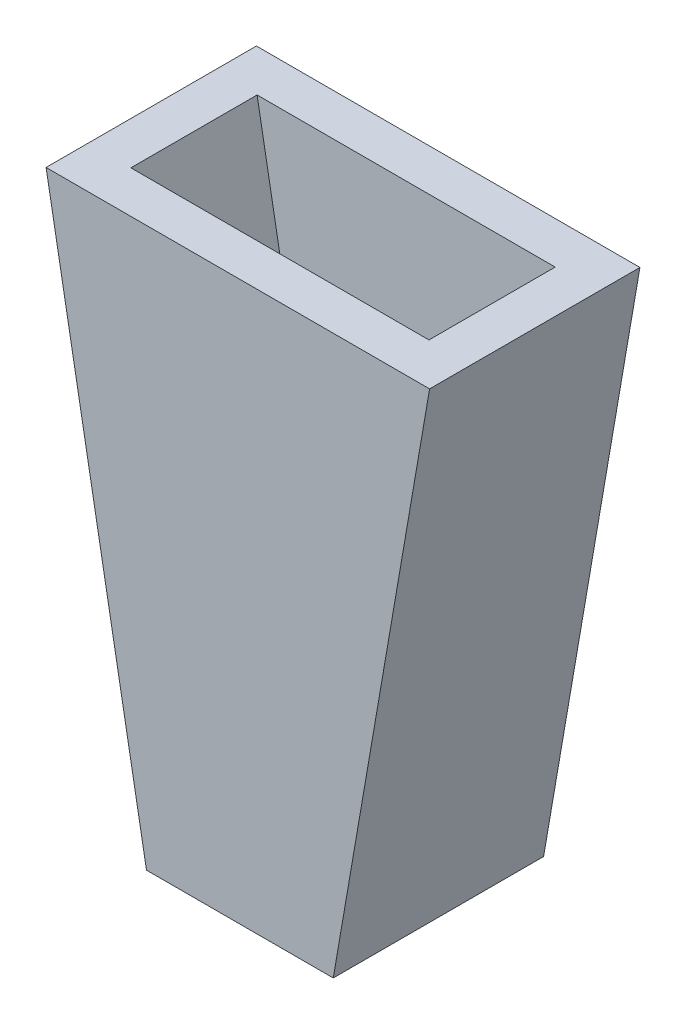
ISO-10303-21;
HEADER;
FILE_DESCRIPTION(('STEP AP214'),'2;1');
FILE_NAME('part.step','',(''),(''),'','','');
FILE_SCHEMA(('AUTOMOTIVE_DESIGN { 1 0 10303 214 1 1 1 1 }'));
ENDSEC;
DATA;
#1=APPLICATION_CONTEXT('core data for automotive mechanical design processes');
#2=APPLICATION_PROTOCOL_DEFINITION('international standard','automotive_design',2000,#1);
#3=PRODUCT_CONTEXT('',#1,'mechanical');
#4=PRODUCT('Part','Part','',(#3));
#5=PRODUCT_RELATED_PRODUCT_CATEGORY('part','',(#4));
#6=PRODUCT_DEFINITION_FORMATION('','',#4);
#7=PRODUCT_DEFINITION_CONTEXT('part definition',#1,'design');
#8=PRODUCT_DEFINITION('design','',#6,#7);
#9=PRODUCT_DEFINITION_SHAPE('','',#8);
#10=(LENGTH_UNIT() NAMED_UNIT(*) SI_UNIT(.MILLI.,.METRE.));
#11=(NAMED_UNIT(*) PLANE_ANGLE_UNIT() SI_UNIT($,.RADIAN.));
#12=(NAMED_UNIT(*) SI_UNIT($,.STERADIAN.) SOLID_ANGLE_UNIT());
#13=UNCERTAINTY_MEASURE_WITH_UNIT(LENGTH_MEASURE(1.E-05),#10,'distance_accuracy_value','');
#14=(GEOMETRIC_REPRESENTATION_CONTEXT(3) GLOBAL_UNCERTAINTY_ASSIGNED_CONTEXT((#13)) GLOBAL_UNIT_ASSIGNED_CONTEXT((#10,
#11,#12)) REPRESENTATION_CONTEXT('',''));
#15=CARTESIAN_POINT('',(0.,0.,0.));
#16=DIRECTION('',(0.,0.,1.));
#17=DIRECTION('',(1.,0.,0.));
#18=AXIS2_PLACEMENT_3D('',#15,#16,#17);
#19=CARTESIAN_POINT('',(-22.1634776557664,55.,7.5));
#20=DIRECTION('',(0.,-1.,0.));
#21=DIRECTION('',(0.,0.,-1.));
#22=AXIS2_PLACEMENT_3D('',#19,#20,#21);
#23=PLANE('',#22);
#24=DIRECTION('',(-1.,0.,0.));
#25=VECTOR('',#24,1.);
#26=CARTESIAN_POINT('',(-22.1634776557664,55.,0.));
#27=LINE('',#26,#25);
#28=CARTESIAN_POINT('',(-8.48767368381687,55.,0.));
#29=VERTEX_POINT('',#28);
#30=CARTESIAN_POINT('',(-22.1634776557664,55.,0.));
#31=VERTEX_POINT('',#30);
#32=EDGE_CURVE('E81',#29,#31,#27,.T.);
#33=ORIENTED_EDGE('',*,*,#32,.T.);
#34=DIRECTION('',(0.,0.,-1.));
#35=VECTOR('',#34,1.);
#36=CARTESIAN_POINT('',(-22.1634776557664,55.,7.5));
#37=LINE('',#36,#35);
#38=CARTESIAN_POINT('',(-22.1634776557664,55.,7.5));
#39=VERTEX_POINT('',#38);
#40=EDGE_CURVE('E153',#39,#31,#37,.T.);
#41=ORIENTED_EDGE('',*,*,#40,.F.);
#42=DIRECTION('',(-1.,0.,0.));
#43=VECTOR('',#42,1.);
#44=CARTESIAN_POINT('',(-15.3589997225136,55.,7.5));
#45=LINE('',#44,#43);
#46=CARTESIAN_POINT('',(-8.48767368381687,55.,7.5));
#47=VERTEX_POINT('',#46);
#48=EDGE_CURVE('E61',#47,#39,#45,.T.);
#49=ORIENTED_EDGE('',*,*,#48,.F.);
#50=DIRECTION('',(0.,0.,-1.));
#51=VECTOR('',#50,1.);
#52=CARTESIAN_POINT('',(-8.48767368381687,55.,7.5));
#53=LINE('',#52,#51);
#54=EDGE_CURVE('E164',#47,#29,#53,.T.);
#55=ORIENTED_EDGE('',*,*,#54,.T.);
#56=EDGE_LOOP('',(#33,#41,#49,#55));
#57=FACE_BOUND('',#56,.T.);
#58=DIRECTION('',(-1.,0.,0.));
#59=VECTOR('',#58,1.);
#60=CARTESIAN_POINT('',(-22.1634776557664,55.,1.5));
#61=LINE('',#60,#59);
#62=CARTESIAN_POINT('',(-10.00983770824,55.,1.5));
#63=VERTEX_POINT('',#62);
#64=CARTESIAN_POINT('',(-20.6394072900315,55.,1.5));
#65=VERTEX_POINT('',#64);
#66=EDGE_CURVE('E134',#63,#65,#61,.T.);
#67=ORIENTED_EDGE('',*,*,#66,.F.);
#68=DIRECTION('',(0.,0.,-1.));
#69=VECTOR('',#68,1.);
#70=CARTESIAN_POINT('',(-10.00983770824,55.,7.5));
#71=LINE('',#70,#69);
#72=CARTESIAN_POINT('',(-10.00983770824,55.,6.));
#73=VERTEX_POINT('',#72);
#74=EDGE_CURVE('E129',#73,#63,#71,.T.);
#75=ORIENTED_EDGE('',*,*,#74,.F.);
#76=DIRECTION('',(-1.,0.,0.));
#77=VECTOR('',#76,1.);
#78=CARTESIAN_POINT('',(-22.1634776557664,55.,6.));
#79=LINE('',#78,#77);
#80=CARTESIAN_POINT('',(-20.6394072900315,55.,6.));
#81=VERTEX_POINT('',#80);
#82=EDGE_CURVE('E52',#73,#81,#79,.T.);
#83=ORIENTED_EDGE('',*,*,#82,.T.);
#84=DIRECTION('',(0.,0.,-1.));
#85=VECTOR('',#84,1.);
#86=CARTESIAN_POINT('',(-20.6394072900315,55.,7.5));
#87=LINE('',#86,#85);
#88=EDGE_CURVE('E142',#81,#65,#87,.T.);
#89=ORIENTED_EDGE('',*,*,#88,.T.);
#90=EDGE_LOOP('',(#67,#75,#83,#89));
#91=FACE_BOUND('',#90,.T.);
#92=ADVANCED_FACE('F37',(#57,#91),#23,.F.);
#93=CARTESIAN_POINT('',(-22.1634776557664,55.,7.5));
#94=DIRECTION('',(0.984206525974073,0.177024049863418,0.));
#95=DIRECTION('',(-0.177024049863418,0.984206525974073,0.));
#96=AXIS2_PLACEMENT_3D('',#93,#94,#95);
#97=PLANE('',#96);
#98=DIRECTION('',(0.177024049863418,-0.984206525974073,0.));
#99=VECTOR('',#98,1.);
#100=CARTESIAN_POINT('',(-22.1634776557664,55.,0.));
#101=LINE('',#100,#99);
#102=CARTESIAN_POINT('',(-18.5823688007984,35.0899894223276,0.));
#103=VERTEX_POINT('',#102);
#104=EDGE_CURVE('E154',#31,#103,#101,.T.);
#105=ORIENTED_EDGE('',*,*,#104,.T.);
#106=DIRECTION('',(0.,0.,-1.));
#107=VECTOR('',#106,1.);
#108=CARTESIAN_POINT('',(-18.5823688007984,35.0899894223276,7.5));
#109=LINE('',#108,#107);
#110=CARTESIAN_POINT('',(-18.5823688007984,35.0899894223276,7.5));
#111=VERTEX_POINT('',#110);
#112=EDGE_CURVE('E11',#111,#103,#109,.T.);
#113=ORIENTED_EDGE('',*,*,#112,.F.);
#114=DIRECTION('',(0.177024049863418,-0.984206525974073,0.));
#115=VECTOR('',#114,1.);
#116=CARTESIAN_POINT('',(-22.1634776557664,55.,7.5));
#117=LINE('',#116,#115);
#118=EDGE_CURVE('E147',#39,#111,#117,.T.);
#119=ORIENTED_EDGE('',*,*,#118,.F.);
#120=ORIENTED_EDGE('',*,*,#40,.T.);
#121=EDGE_LOOP('',(#105,#113,#119,#120));
#122=FACE_BOUND('',#121,.T.);
#123=ADVANCED_FACE('F39',(#122),#97,.F.);
#124=CARTESIAN_POINT('',(-18.5823688007984,35.0899894223276,7.5));
#125=DIRECTION('',(0.,1.,0.));
#126=DIRECTION('',(0.,0.,1.));
#127=AXIS2_PLACEMENT_3D('',#124,#125,#126);
#128=PLANE('',#127);
#129=DIRECTION('',(1.,0.,0.));
#130=VECTOR('',#129,1.);
#131=CARTESIAN_POINT('',(-18.5823688007984,35.0899894223276,0.));
#132=LINE('',#131,#130);
#133=CARTESIAN_POINT('',(-11.9229648883916,35.0899894223276,0.));
#134=VERTEX_POINT('',#133);
#135=EDGE_CURVE('E157',#103,#134,#132,.T.);
#136=ORIENTED_EDGE('',*,*,#135,.T.);
#137=DIRECTION('',(0.,0.,-1.));
#138=VECTOR('',#137,1.);
#139=CARTESIAN_POINT('',(-11.9229648883916,35.0899894223276,7.5));
#140=LINE('',#139,#138);
#141=CARTESIAN_POINT('',(-11.9229648883916,35.0899894223276,7.5));
#142=VERTEX_POINT('',#141);
#143=EDGE_CURVE('E45',#142,#134,#140,.T.);
#144=ORIENTED_EDGE('',*,*,#143,.F.);
#145=DIRECTION('',(1.,0.,0.));
#146=VECTOR('',#145,1.);
#147=CARTESIAN_POINT('',(-18.5823688007984,35.0899894223276,7.5));
#148=LINE('',#147,#146);
#149=EDGE_CURVE('E88',#111,#142,#148,.T.);
#150=ORIENTED_EDGE('',*,*,#149,.F.);
#151=ORIENTED_EDGE('',*,*,#112,.T.);
#152=EDGE_LOOP('',(#136,#144,#150,#151));
#153=FACE_BOUND('',#152,.T.);
#154=ADVANCED_FACE('F203',(#153),#128,.F.);
#155=CARTESIAN_POINT('',(-11.9229648883916,35.0899894223276,7.5));
#156=DIRECTION('',(-0.985439135291946,0.170028558292604,0.));
#157=DIRECTION('',(-0.170028558292604,-0.985439135291946,0.));
#158=AXIS2_PLACEMENT_3D('',#155,#156,#157);
#159=PLANE('',#158);
#160=DIRECTION('',(0.170028558292604,0.985439135291946,0.));
#161=VECTOR('',#160,1.);
#162=CARTESIAN_POINT('',(-11.9229648883916,35.0899894223276,0.));
#163=LINE('',#162,#161);
#164=EDGE_CURVE('E159',#134,#29,#163,.T.);
#165=ORIENTED_EDGE('',*,*,#164,.T.);
#166=ORIENTED_EDGE('',*,*,#54,.F.);
#167=DIRECTION('',(0.170028558292604,0.985439135291946,0.));
#168=VECTOR('',#167,1.);
#169=CARTESIAN_POINT('',(-11.9229648883916,35.0899894223276,7.5));
#170=LINE('',#169,#168);
#171=EDGE_CURVE('E150',#142,#47,#170,.T.);
#172=ORIENTED_EDGE('',*,*,#171,.F.);
#173=ORIENTED_EDGE('',*,*,#143,.T.);
#174=EDGE_LOOP('',(#165,#166,#172,#173));
#175=FACE_BOUND('',#174,.T.);
#176=ADVANCED_FACE('F169',(#175),#159,.F.);
#177=CARTESIAN_POINT('',(0.,0.,7.5));
#178=DIRECTION('',(0.,0.,1.));
#179=DIRECTION('',(1.,0.,0.));
#180=AXIS2_PLACEMENT_3D('',#177,#178,#179);
#181=PLANE('',#180);
#182=ORIENTED_EDGE('',*,*,#118,.T.);
#183=ORIENTED_EDGE('',*,*,#149,.T.);
#184=ORIENTED_EDGE('',*,*,#171,.T.);
#185=ORIENTED_EDGE('',*,*,#48,.T.);
#186=EDGE_LOOP('',(#182,#183,#184,#185));
#187=FACE_BOUND('',#186,.T.);
#188=ADVANCED_FACE('F197',(#187),#181,.T.);
#189=CARTESIAN_POINT('',(0.,0.,0.));
#190=DIRECTION('',(0.,0.,1.));
#191=DIRECTION('',(1.,0.,0.));
#192=AXIS2_PLACEMENT_3D('',#189,#190,#191);
#193=PLANE('',#192);
#194=ORIENTED_EDGE('',*,*,#104,.F.);
#195=ORIENTED_EDGE('',*,*,#32,.F.);
#196=ORIENTED_EDGE('',*,*,#164,.F.);
#197=ORIENTED_EDGE('',*,*,#135,.F.);
#198=EDGE_LOOP('',(#194,#195,#196,#197));
#199=FACE_BOUND('',#198,.T.);
#200=ADVANCED_FACE('F173',(#199),#193,.F.);
#201=CARTESIAN_POINT('',(-20.6871678668053,55.2655360747951,7.5));
#202=DIRECTION('',(0.984206525974073,0.177024049863418,0.));
#203=DIRECTION('',(-0.177024049863418,0.984206525974073,0.));
#204=AXIS2_PLACEMENT_3D('',#201,#202,#203);
#205=PLANE('',#204);
#206=DIRECTION('',(0.177024049863418,-0.984206525974073,0.));
#207=VECTOR('',#206,1.);
#208=CARTESIAN_POINT('',(-20.6871678668053,55.2655360747951,1.5));
#209=LINE('',#208,#207);
#210=CARTESIAN_POINT('',(-17.3280955434827,36.5899894223276,1.5));
#211=VERTEX_POINT('',#210);
#212=EDGE_CURVE('E118',#65,#211,#209,.T.);
#213=ORIENTED_EDGE('',*,*,#212,.F.);
#214=ORIENTED_EDGE('',*,*,#88,.F.);
#215=DIRECTION('',(0.177024049863418,-0.984206525974073,0.));
#216=VECTOR('',#215,1.);
#217=CARTESIAN_POINT('',(-20.6871678668053,55.2655360747951,6.));
#218=LINE('',#217,#216);
#219=CARTESIAN_POINT('',(-17.3280955434827,36.5899894223276,6.));
#220=VERTEX_POINT('',#219);
#221=EDGE_CURVE('E136',#81,#220,#218,.T.);
#222=ORIENTED_EDGE('',*,*,#221,.T.);
#223=DIRECTION('',(0.,0.,-1.));
#224=VECTOR('',#223,1.);
#225=CARTESIAN_POINT('',(-17.3280955434827,36.5899894223276,7.5));
#226=LINE('',#225,#224);
#227=EDGE_CURVE('E128',#220,#211,#226,.T.);
#228=ORIENTED_EDGE('',*,*,#227,.T.);
#229=EDGE_LOOP('',(#213,#214,#222,#228));
#230=FACE_BOUND('',#229,.T.);
#231=ADVANCED_FACE('F181',(#230),#205,.T.);
#232=CARTESIAN_POINT('',(-18.5823688007984,36.5899894223276,7.5));
#233=DIRECTION('',(0.,1.,0.));
#234=DIRECTION('',(0.,0.,1.));
#235=AXIS2_PLACEMENT_3D('',#232,#233,#234);
#236=PLANE('',#235);
#237=DIRECTION('',(1.,0.,0.));
#238=VECTOR('',#237,1.);
#239=CARTESIAN_POINT('',(-18.5823688007984,36.5899894223276,1.5));
#240=LINE('',#239,#238);
#241=CARTESIAN_POINT('',(-13.1863175582572,36.5899894223276,1.5));
#242=VERTEX_POINT('',#241);
#243=EDGE_CURVE('E111',#211,#242,#240,.T.);
#244=ORIENTED_EDGE('',*,*,#243,.F.);
#245=ORIENTED_EDGE('',*,*,#227,.F.);
#246=DIRECTION('',(1.,0.,0.));
#247=VECTOR('',#246,1.);
#248=CARTESIAN_POINT('',(-18.5823688007984,36.5899894223276,6.));
#249=LINE('',#248,#247);
#250=CARTESIAN_POINT('',(-13.1863175582572,36.5899894223276,6.));
#251=VERTEX_POINT('',#250);
#252=EDGE_CURVE('E126',#220,#251,#249,.T.);
#253=ORIENTED_EDGE('',*,*,#252,.T.);
#254=DIRECTION('',(0.,0.,-1.));
#255=VECTOR('',#254,1.);
#256=CARTESIAN_POINT('',(-13.1863175582572,36.5899894223276,7.5));
#257=LINE('',#256,#255);
#258=EDGE_CURVE('E124',#251,#242,#257,.T.);
#259=ORIENTED_EDGE('',*,*,#258,.T.);
#260=EDGE_LOOP('',(#244,#245,#253,#259));
#261=FACE_BOUND('',#260,.T.);
#262=ADVANCED_FACE('F125',(#261),#236,.T.);
#263=CARTESIAN_POINT('',(-13.4011235913295,35.3450322597665,7.5));
#264=DIRECTION('',(-0.985439135291946,0.170028558292604,0.));
#265=DIRECTION('',(-0.170028558292604,-0.985439135291946,0.));
#266=AXIS2_PLACEMENT_3D('',#263,#264,#265);
#267=PLANE('',#266);
#268=DIRECTION('',(0.170028558292604,0.985439135291946,0.));
#269=VECTOR('',#268,1.);
#270=CARTESIAN_POINT('',(-13.4011235913295,35.3450322597665,1.5));
#271=LINE('',#270,#269);
#272=EDGE_CURVE('E115',#242,#63,#271,.T.);
#273=ORIENTED_EDGE('',*,*,#272,.F.);
#274=ORIENTED_EDGE('',*,*,#258,.F.);
#275=DIRECTION('',(0.170028558292604,0.985439135291946,0.));
#276=VECTOR('',#275,1.);
#277=CARTESIAN_POINT('',(-13.4011235913295,35.3450322597665,6.));
#278=LINE('',#277,#276);
#279=EDGE_CURVE('E140',#251,#73,#278,.T.);
#280=ORIENTED_EDGE('',*,*,#279,.T.);
#281=ORIENTED_EDGE('',*,*,#74,.T.);
#282=EDGE_LOOP('',(#273,#274,#280,#281));
#283=FACE_BOUND('',#282,.T.);
#284=ADVANCED_FACE('F131',(#283),#267,.T.);
#285=CARTESIAN_POINT('',(0.,0.,6.));
#286=DIRECTION('',(0.,0.,1.));
#287=DIRECTION('',(1.,0.,0.));
#288=AXIS2_PLACEMENT_3D('',#285,#286,#287);
#289=PLANE('',#288);
#290=ORIENTED_EDGE('',*,*,#221,.F.);
#291=ORIENTED_EDGE('',*,*,#82,.F.);
#292=ORIENTED_EDGE('',*,*,#279,.F.);
#293=ORIENTED_EDGE('',*,*,#252,.F.);
#294=EDGE_LOOP('',(#290,#291,#292,#293));
#295=FACE_BOUND('',#294,.T.);
#296=ADVANCED_FACE('F186',(#295),#289,.F.);
#297=CARTESIAN_POINT('',(0.,0.,1.5));
#298=DIRECTION('',(0.,0.,1.));
#299=DIRECTION('',(1.,0.,0.));
#300=AXIS2_PLACEMENT_3D('',#297,#298,#299);
#301=PLANE('',#300);
#302=ORIENTED_EDGE('',*,*,#212,.T.);
#303=ORIENTED_EDGE('',*,*,#243,.T.);
#304=ORIENTED_EDGE('',*,*,#272,.T.);
#305=ORIENTED_EDGE('',*,*,#66,.T.);
#306=EDGE_LOOP('',(#302,#303,#304,#305));
#307=FACE_BOUND('',#306,.T.);
#308=ADVANCED_FACE('F113',(#307),#301,.T.);
#309=CLOSED_SHELL('',(#92,#123,#154,#176,#188,#200,#231,#262,#284,#296,#308));
#310=MANIFOLD_SOLID_BREP('B2',#309);
#311=ADVANCED_BREP_SHAPE_REPRESENTATION('',(#18,#310),#14);
#312=SHAPE_DEFINITION_REPRESENTATION(#9,#311);
ENDSEC;
END-ISO-10303-21;
